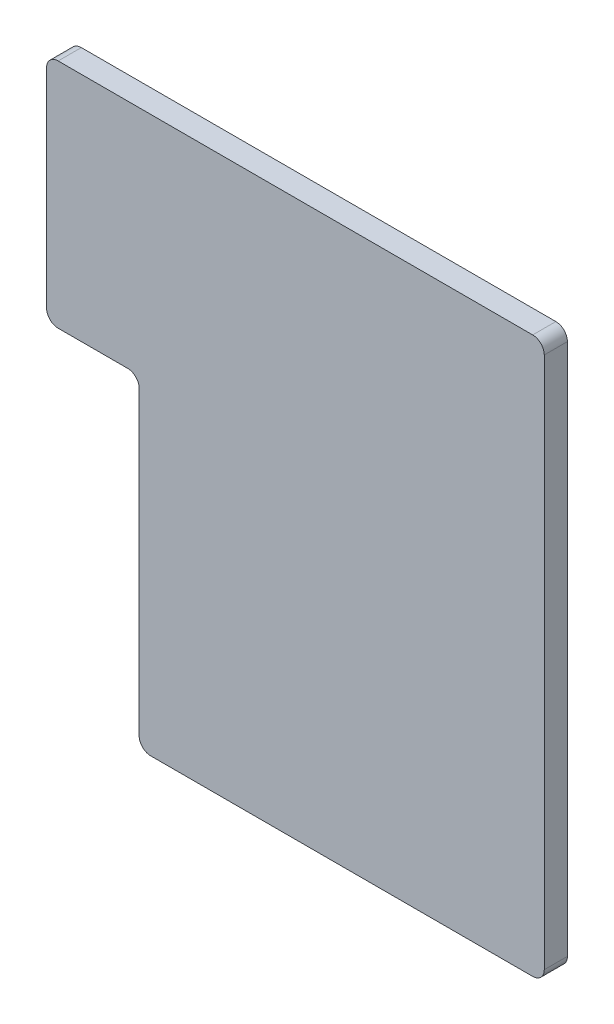
ISO-10303-21;
HEADER;
FILE_DESCRIPTION(('STEP AP214'),'2;1');
FILE_NAME('part.step','',(''),(''),'','','');
FILE_SCHEMA(('AUTOMOTIVE_DESIGN { 1 0 10303 214 1 1 1 1 }'));
ENDSEC;
DATA;
#1=APPLICATION_CONTEXT('core data for automotive mechanical design processes');
#2=APPLICATION_PROTOCOL_DEFINITION('international standard','automotive_design',2000,#1);
#3=PRODUCT_CONTEXT('',#1,'mechanical');
#4=PRODUCT('Part','Part','',(#3));
#5=PRODUCT_RELATED_PRODUCT_CATEGORY('part','',(#4));
#6=PRODUCT_DEFINITION_FORMATION('','',#4);
#7=PRODUCT_DEFINITION_CONTEXT('part definition',#1,'design');
#8=PRODUCT_DEFINITION('design','',#6,#7);
#9=PRODUCT_DEFINITION_SHAPE('','',#8);
#10=(LENGTH_UNIT() NAMED_UNIT(*) SI_UNIT(.MILLI.,.METRE.));
#11=(NAMED_UNIT(*) PLANE_ANGLE_UNIT() SI_UNIT($,.RADIAN.));
#12=(NAMED_UNIT(*) SI_UNIT($,.STERADIAN.) SOLID_ANGLE_UNIT());
#13=UNCERTAINTY_MEASURE_WITH_UNIT(LENGTH_MEASURE(1.E-05),#10,'distance_accuracy_value','');
#14=(GEOMETRIC_REPRESENTATION_CONTEXT(3) GLOBAL_UNCERTAINTY_ASSIGNED_CONTEXT((#13)) GLOBAL_UNIT_ASSIGNED_CONTEXT((#10,
#11,#12)) REPRESENTATION_CONTEXT('',''));
#15=CARTESIAN_POINT('',(0.,0.,0.));
#16=DIRECTION('',(0.,0.,1.));
#17=DIRECTION('',(1.,0.,0.));
#18=AXIS2_PLACEMENT_3D('',#15,#16,#17);
#19=CARTESIAN_POINT('',(17.,0.5,1.));
#20=DIRECTION('',(0.,0.,-1.));
#21=DIRECTION('',(-1.,0.,0.));
#22=AXIS2_PLACEMENT_3D('',#19,#20,#21);
#23=CYLINDRICAL_SURFACE('',#22,0.5);
#24=CARTESIAN_POINT('',(17.,0.5,0.));
#25=DIRECTION('',(0.,0.,1.));
#26=DIRECTION('',(1.,0.,0.));
#27=AXIS2_PLACEMENT_3D('',#24,#25,#26);
#28=CIRCLE('',#27,0.5);
#29=CARTESIAN_POINT('',(17.,0.,0.));
#30=VERTEX_POINT('',#29);
#31=CARTESIAN_POINT('',(17.5,0.500000000000004,0.));
#32=VERTEX_POINT('',#31);
#33=EDGE_CURVE('E248',#30,#32,#28,.T.);
#34=ORIENTED_EDGE('',*,*,#33,.T.);
#35=DIRECTION('',(0.,0.,-1.));
#36=VECTOR('',#35,1.);
#37=CARTESIAN_POINT('',(17.5,0.500000000000004,1.));
#38=LINE('',#37,#36);
#39=CARTESIAN_POINT('',(17.5,0.500000000000004,1.));
#40=VERTEX_POINT('',#39);
#41=EDGE_CURVE('E12',#40,#32,#38,.T.);
#42=ORIENTED_EDGE('',*,*,#41,.F.);
#43=CARTESIAN_POINT('',(17.,0.5,1.));
#44=DIRECTION('',(0.,0.,1.));
#45=DIRECTION('',(1.,0.,0.));
#46=AXIS2_PLACEMENT_3D('',#43,#44,#45);
#47=CIRCLE('',#46,0.5);
#48=CARTESIAN_POINT('',(17.,0.,1.));
#49=VERTEX_POINT('',#48);
#50=EDGE_CURVE('E201',#49,#40,#47,.T.);
#51=ORIENTED_EDGE('',*,*,#50,.F.);
#52=DIRECTION('',(0.,0.,-1.));
#53=VECTOR('',#52,1.);
#54=CARTESIAN_POINT('',(17.,0.,1.));
#55=LINE('',#54,#53);
#56=EDGE_CURVE('E157',#49,#30,#55,.T.);
#57=ORIENTED_EDGE('',*,*,#56,.T.);
#58=EDGE_LOOP('',(#34,#42,#51,#57));
#59=FACE_BOUND('',#58,.T.);
#60=ADVANCED_FACE('F38',(#59),#23,.T.);
#61=CARTESIAN_POINT('',(17.5,0.500000000000004,1.));
#62=DIRECTION('',(-1.,0.,0.));
#63=DIRECTION('',(0.,0.,1.));
#64=AXIS2_PLACEMENT_3D('',#61,#62,#63);
#65=PLANE('',#64);
#66=DIRECTION('',(0.,1.,0.));
#67=VECTOR('',#66,1.);
#68=CARTESIAN_POINT('',(17.5,0.500000000000004,0.));
#69=LINE('',#68,#67);
#70=CARTESIAN_POINT('',(17.5,23.5,0.));
#71=VERTEX_POINT('',#70);
#72=EDGE_CURVE('E242',#32,#71,#69,.T.);
#73=ORIENTED_EDGE('',*,*,#72,.T.);
#74=DIRECTION('',(0.,0.,-1.));
#75=VECTOR('',#74,1.);
#76=CARTESIAN_POINT('',(17.5,23.5,1.));
#77=LINE('',#76,#75);
#78=CARTESIAN_POINT('',(17.5,23.5,1.));
#79=VERTEX_POINT('',#78);
#80=EDGE_CURVE('E46',#79,#71,#77,.T.);
#81=ORIENTED_EDGE('',*,*,#80,.F.);
#82=DIRECTION('',(0.,1.,0.));
#83=VECTOR('',#82,1.);
#84=CARTESIAN_POINT('',(17.5,0.500000000000004,1.));
#85=LINE('',#84,#83);
#86=EDGE_CURVE('E109',#40,#79,#85,.T.);
#87=ORIENTED_EDGE('',*,*,#86,.F.);
#88=ORIENTED_EDGE('',*,*,#41,.T.);
#89=EDGE_LOOP('',(#73,#81,#87,#88));
#90=FACE_BOUND('',#89,.T.);
#91=ADVANCED_FACE('F277',(#90),#65,.F.);
#92=CARTESIAN_POINT('',(17.,23.5,1.));
#93=DIRECTION('',(0.,0.,-1.));
#94=DIRECTION('',(-1.,0.,0.));
#95=AXIS2_PLACEMENT_3D('',#92,#93,#94);
#96=CYLINDRICAL_SURFACE('',#95,0.5);
#97=CARTESIAN_POINT('',(17.,23.5,0.));
#98=DIRECTION('',(0.,0.,1.));
#99=DIRECTION('',(-1.,0.,0.));
#100=AXIS2_PLACEMENT_3D('',#97,#98,#99);
#101=CIRCLE('',#100,0.5);
#102=CARTESIAN_POINT('',(17.,24.,0.));
#103=VERTEX_POINT('',#102);
#104=EDGE_CURVE('E238',#71,#103,#101,.T.);
#105=ORIENTED_EDGE('',*,*,#104,.T.);
#106=DIRECTION('',(0.,0.,-1.));
#107=VECTOR('',#106,1.);
#108=CARTESIAN_POINT('',(17.,24.,1.));
#109=LINE('',#108,#107);
#110=CARTESIAN_POINT('',(17.,24.,1.));
#111=VERTEX_POINT('',#110);
#112=EDGE_CURVE('E229',#111,#103,#109,.T.);
#113=ORIENTED_EDGE('',*,*,#112,.F.);
#114=CARTESIAN_POINT('',(17.,23.5,1.));
#115=DIRECTION('',(0.,0.,1.));
#116=DIRECTION('',(-1.,0.,0.));
#117=AXIS2_PLACEMENT_3D('',#114,#115,#116);
#118=CIRCLE('',#117,0.5);
#119=EDGE_CURVE('E193',#79,#111,#118,.T.);
#120=ORIENTED_EDGE('',*,*,#119,.F.);
#121=ORIENTED_EDGE('',*,*,#80,.T.);
#122=EDGE_LOOP('',(#105,#113,#120,#121));
#123=FACE_BOUND('',#122,.T.);
#124=ADVANCED_FACE('F236',(#123),#96,.T.);
#125=CARTESIAN_POINT('',(1.5,24.,1.));
#126=DIRECTION('',(0.,-1.,0.));
#127=DIRECTION('',(0.,0.,-1.));
#128=AXIS2_PLACEMENT_3D('',#125,#126,#127);
#129=PLANE('',#128);
#130=DIRECTION('',(-1.,0.,0.));
#131=VECTOR('',#130,1.);
#132=CARTESIAN_POINT('',(1.5,24.,0.));
#133=LINE('',#132,#131);
#134=CARTESIAN_POINT('',(-3.5,24.,0.));
#135=VERTEX_POINT('',#134);
#136=EDGE_CURVE('E244',#103,#135,#133,.T.);
#137=ORIENTED_EDGE('',*,*,#136,.T.);
#138=DIRECTION('',(0.,0.,-1.));
#139=VECTOR('',#138,1.);
#140=CARTESIAN_POINT('',(-3.5,24.,1.));
#141=LINE('',#140,#139);
#142=CARTESIAN_POINT('',(-3.5,24.,1.));
#143=VERTEX_POINT('',#142);
#144=EDGE_CURVE('E226',#143,#135,#141,.T.);
#145=ORIENTED_EDGE('',*,*,#144,.F.);
#146=DIRECTION('',(-1.,0.,0.));
#147=VECTOR('',#146,1.);
#148=CARTESIAN_POINT('',(1.5,24.,1.));
#149=LINE('',#148,#147);
#150=EDGE_CURVE('E189',#111,#143,#149,.T.);
#151=ORIENTED_EDGE('',*,*,#150,.F.);
#152=ORIENTED_EDGE('',*,*,#112,.T.);
#153=EDGE_LOOP('',(#137,#145,#151,#152));
#154=FACE_BOUND('',#153,.T.);
#155=ADVANCED_FACE('F284',(#154),#129,.F.);
#156=CARTESIAN_POINT('',(-3.5,23.5,1.));
#157=DIRECTION('',(0.,0.,-1.));
#158=DIRECTION('',(-1.,0.,0.));
#159=AXIS2_PLACEMENT_3D('',#156,#157,#158);
#160=CYLINDRICAL_SURFACE('',#159,0.5);
#161=CARTESIAN_POINT('',(-3.5,23.5,0.));
#162=DIRECTION('',(0.,0.,1.));
#163=DIRECTION('',(1.,0.,0.));
#164=AXIS2_PLACEMENT_3D('',#161,#162,#163);
#165=CIRCLE('',#164,0.5);
#166=CARTESIAN_POINT('',(-4.,23.5,0.));
#167=VERTEX_POINT('',#166);
#168=EDGE_CURVE('E246',#135,#167,#165,.T.);
#169=ORIENTED_EDGE('',*,*,#168,.T.);
#170=DIRECTION('',(0.,0.,-1.));
#171=VECTOR('',#170,1.);
#172=CARTESIAN_POINT('',(-4.,23.5,1.));
#173=LINE('',#172,#171);
#174=CARTESIAN_POINT('',(-4.,23.5,1.));
#175=VERTEX_POINT('',#174);
#176=EDGE_CURVE('E223',#175,#167,#173,.T.);
#177=ORIENTED_EDGE('',*,*,#176,.F.);
#178=CARTESIAN_POINT('',(-3.5,23.5,1.));
#179=DIRECTION('',(0.,0.,1.));
#180=DIRECTION('',(1.,0.,0.));
#181=AXIS2_PLACEMENT_3D('',#178,#179,#180);
#182=CIRCLE('',#181,0.5);
#183=EDGE_CURVE('E186',#143,#175,#182,.T.);
#184=ORIENTED_EDGE('',*,*,#183,.F.);
#185=ORIENTED_EDGE('',*,*,#144,.T.);
#186=EDGE_LOOP('',(#169,#177,#184,#185));
#187=FACE_BOUND('',#186,.T.);
#188=ADVANCED_FACE('F289',(#187),#160,.T.);
#189=CARTESIAN_POINT('',(-4.,23.5,1.));
#190=DIRECTION('',(1.,0.,0.));
#191=DIRECTION('',(0.,1.,0.));
#192=AXIS2_PLACEMENT_3D('',#189,#190,#191);
#193=PLANE('',#192);
#194=DIRECTION('',(0.,-1.,0.));
#195=VECTOR('',#194,1.);
#196=CARTESIAN_POINT('',(-4.,23.5,0.));
#197=LINE('',#196,#195);
#198=CARTESIAN_POINT('',(-4.,14.5,0.));
#199=VERTEX_POINT('',#198);
#200=EDGE_CURVE('E252',#167,#199,#197,.T.);
#201=ORIENTED_EDGE('',*,*,#200,.T.);
#202=DIRECTION('',(0.,0.,-1.));
#203=VECTOR('',#202,1.);
#204=CARTESIAN_POINT('',(-4.,14.5,1.));
#205=LINE('',#204,#203);
#206=CARTESIAN_POINT('',(-4.,14.5,1.));
#207=VERTEX_POINT('',#206);
#208=EDGE_CURVE('E220',#207,#199,#205,.T.);
#209=ORIENTED_EDGE('',*,*,#208,.F.);
#210=DIRECTION('',(0.,-1.,0.));
#211=VECTOR('',#210,1.);
#212=CARTESIAN_POINT('',(-4.,23.5,1.));
#213=LINE('',#212,#211);
#214=EDGE_CURVE('E178',#175,#207,#213,.T.);
#215=ORIENTED_EDGE('',*,*,#214,.F.);
#216=ORIENTED_EDGE('',*,*,#176,.T.);
#217=EDGE_LOOP('',(#201,#209,#215,#216));
#218=FACE_BOUND('',#217,.T.);
#219=ADVANCED_FACE('F293',(#218),#193,.F.);
#220=CARTESIAN_POINT('',(-3.5,14.5,1.));
#221=DIRECTION('',(0.,0.,-1.));
#222=DIRECTION('',(-1.,0.,0.));
#223=AXIS2_PLACEMENT_3D('',#220,#221,#222);
#224=CYLINDRICAL_SURFACE('',#223,0.5);
#225=CARTESIAN_POINT('',(-3.5,14.5,0.));
#226=DIRECTION('',(0.,0.,1.));
#227=DIRECTION('',(1.,0.,0.));
#228=AXIS2_PLACEMENT_3D('',#225,#226,#227);
#229=CIRCLE('',#228,0.5);
#230=CARTESIAN_POINT('',(-3.5,14.,0.));
#231=VERTEX_POINT('',#230);
#232=EDGE_CURVE('E254',#199,#231,#229,.T.);
#233=ORIENTED_EDGE('',*,*,#232,.T.);
#234=DIRECTION('',(0.,0.,-1.));
#235=VECTOR('',#234,1.);
#236=CARTESIAN_POINT('',(-3.5,14.,1.));
#237=LINE('',#236,#235);
#238=CARTESIAN_POINT('',(-3.5,14.,1.));
#239=VERTEX_POINT('',#238);
#240=EDGE_CURVE('E217',#239,#231,#237,.T.);
#241=ORIENTED_EDGE('',*,*,#240,.F.);
#242=CARTESIAN_POINT('',(-3.5,14.5,1.));
#243=DIRECTION('',(0.,0.,1.));
#244=DIRECTION('',(1.,0.,0.));
#245=AXIS2_PLACEMENT_3D('',#242,#243,#244);
#246=CIRCLE('',#245,0.5);
#247=EDGE_CURVE('E174',#207,#239,#246,.T.);
#248=ORIENTED_EDGE('',*,*,#247,.F.);
#249=ORIENTED_EDGE('',*,*,#208,.T.);
#250=EDGE_LOOP('',(#233,#241,#248,#249));
#251=FACE_BOUND('',#250,.T.);
#252=ADVANCED_FACE('F297',(#251),#224,.T.);
#253=CARTESIAN_POINT('',(-3.5,14.,1.));
#254=DIRECTION('',(0.,1.,0.));
#255=DIRECTION('',(0.,0.,1.));
#256=AXIS2_PLACEMENT_3D('',#253,#254,#255);
#257=PLANE('',#256);
#258=DIRECTION('',(1.,0.,0.));
#259=VECTOR('',#258,1.);
#260=CARTESIAN_POINT('',(-3.5,14.,0.));
#261=LINE('',#260,#259);
#262=CARTESIAN_POINT('',(-0.500000000000004,14.,0.));
#263=VERTEX_POINT('',#262);
#264=EDGE_CURVE('E256',#231,#263,#261,.T.);
#265=ORIENTED_EDGE('',*,*,#264,.T.);
#266=DIRECTION('',(0.,0.,-1.));
#267=VECTOR('',#266,1.);
#268=CARTESIAN_POINT('',(-0.500000000000004,14.,1.));
#269=LINE('',#268,#267);
#270=CARTESIAN_POINT('',(-0.500000000000004,14.,1.));
#271=VERTEX_POINT('',#270);
#272=EDGE_CURVE('E214',#271,#263,#269,.T.);
#273=ORIENTED_EDGE('',*,*,#272,.F.);
#274=DIRECTION('',(1.,0.,0.));
#275=VECTOR('',#274,1.);
#276=CARTESIAN_POINT('',(-3.5,14.,1.));
#277=LINE('',#276,#275);
#278=EDGE_CURVE('E170',#239,#271,#277,.T.);
#279=ORIENTED_EDGE('',*,*,#278,.F.);
#280=ORIENTED_EDGE('',*,*,#240,.T.);
#281=EDGE_LOOP('',(#265,#273,#279,#280));
#282=FACE_BOUND('',#281,.T.);
#283=ADVANCED_FACE('F301',(#282),#257,.F.);
#284=CARTESIAN_POINT('',(-0.5,13.5,1.));
#285=DIRECTION('',(0.,0.,-1.));
#286=DIRECTION('',(-1.,0.,0.));
#287=AXIS2_PLACEMENT_3D('',#284,#285,#286);
#288=CYLINDRICAL_SURFACE('',#287,0.5);
#289=CARTESIAN_POINT('',(-0.5,13.5,0.));
#290=DIRECTION('',(0.,0.,-1.));
#291=DIRECTION('',(-1.,0.,0.));
#292=AXIS2_PLACEMENT_3D('',#289,#290,#291);
#293=CIRCLE('',#292,0.5);
#294=CARTESIAN_POINT('',(0.,13.5,0.));
#295=VERTEX_POINT('',#294);
#296=EDGE_CURVE('E258',#263,#295,#293,.T.);
#297=ORIENTED_EDGE('',*,*,#296,.T.);
#298=DIRECTION('',(0.,0.,-1.));
#299=VECTOR('',#298,1.);
#300=CARTESIAN_POINT('',(0.,13.5,1.));
#301=LINE('',#300,#299);
#302=CARTESIAN_POINT('',(0.,13.5,1.));
#303=VERTEX_POINT('',#302);
#304=EDGE_CURVE('E150',#303,#295,#301,.T.);
#305=ORIENTED_EDGE('',*,*,#304,.F.);
#306=CARTESIAN_POINT('',(-0.5,13.5,1.));
#307=DIRECTION('',(0.,0.,-1.));
#308=DIRECTION('',(-1.,0.,0.));
#309=AXIS2_PLACEMENT_3D('',#306,#307,#308);
#310=CIRCLE('',#309,0.5);
#311=EDGE_CURVE('E140',#271,#303,#310,.T.);
#312=ORIENTED_EDGE('',*,*,#311,.F.);
#313=ORIENTED_EDGE('',*,*,#272,.T.);
#314=EDGE_LOOP('',(#297,#305,#312,#313));
#315=FACE_BOUND('',#314,.T.);
#316=ADVANCED_FACE('F261',(#315),#288,.F.);
#317=CARTESIAN_POINT('',(0.,0.500000000000004,1.));
#318=DIRECTION('',(1.,0.,0.));
#319=DIRECTION('',(0.,0.,-1.));
#320=AXIS2_PLACEMENT_3D('',#317,#318,#319);
#321=PLANE('',#320);
#322=DIRECTION('',(0.,-1.,0.));
#323=VECTOR('',#322,1.);
#324=CARTESIAN_POINT('',(0.,0.500000000000004,0.));
#325=LINE('',#324,#323);
#326=CARTESIAN_POINT('',(0.,0.5,0.));
#327=VERTEX_POINT('',#326);
#328=EDGE_CURVE('E149',#295,#327,#325,.T.);
#329=ORIENTED_EDGE('',*,*,#328,.T.);
#330=DIRECTION('',(0.,0.,-1.));
#331=VECTOR('',#330,1.);
#332=CARTESIAN_POINT('',(0.,0.5,1.));
#333=LINE('',#332,#331);
#334=CARTESIAN_POINT('',(0.,0.5,1.));
#335=VERTEX_POINT('',#334);
#336=EDGE_CURVE('E146',#335,#327,#333,.T.);
#337=ORIENTED_EDGE('',*,*,#336,.F.);
#338=DIRECTION('',(0.,-1.,0.));
#339=VECTOR('',#338,1.);
#340=CARTESIAN_POINT('',(0.,0.500000000000004,1.));
#341=LINE('',#340,#339);
#342=EDGE_CURVE('E134',#303,#335,#341,.T.);
#343=ORIENTED_EDGE('',*,*,#342,.F.);
#344=ORIENTED_EDGE('',*,*,#304,.T.);
#345=EDGE_LOOP('',(#329,#337,#343,#344));
#346=FACE_BOUND('',#345,.T.);
#347=ADVANCED_FACE('F147',(#346),#321,.F.);
#348=CARTESIAN_POINT('',(0.5,0.5,1.));
#349=DIRECTION('',(0.,0.,-1.));
#350=DIRECTION('',(-1.,0.,0.));
#351=AXIS2_PLACEMENT_3D('',#348,#349,#350);
#352=CYLINDRICAL_SURFACE('',#351,0.5);
#353=CARTESIAN_POINT('',(0.5,0.5,0.));
#354=DIRECTION('',(0.,0.,1.));
#355=DIRECTION('',(-1.,0.,0.));
#356=AXIS2_PLACEMENT_3D('',#353,#354,#355);
#357=CIRCLE('',#356,0.5);
#358=CARTESIAN_POINT('',(0.500000000000004,0.,0.));
#359=VERTEX_POINT('',#358);
#360=EDGE_CURVE('E95',#327,#359,#357,.T.);
#361=ORIENTED_EDGE('',*,*,#360,.T.);
#362=DIRECTION('',(0.,0.,-1.));
#363=VECTOR('',#362,1.);
#364=CARTESIAN_POINT('',(0.500000000000004,0.,1.));
#365=LINE('',#364,#363);
#366=CARTESIAN_POINT('',(0.500000000000004,0.,1.));
#367=VERTEX_POINT('',#366);
#368=EDGE_CURVE('E151',#367,#359,#365,.T.);
#369=ORIENTED_EDGE('',*,*,#368,.F.);
#370=CARTESIAN_POINT('',(0.5,0.5,1.));
#371=DIRECTION('',(0.,0.,1.));
#372=DIRECTION('',(-1.,0.,0.));
#373=AXIS2_PLACEMENT_3D('',#370,#371,#372);
#374=CIRCLE('',#373,0.5);
#375=EDGE_CURVE('E138',#335,#367,#374,.T.);
#376=ORIENTED_EDGE('',*,*,#375,.F.);
#377=ORIENTED_EDGE('',*,*,#336,.T.);
#378=EDGE_LOOP('',(#361,#369,#376,#377));
#379=FACE_BOUND('',#378,.T.);
#380=ADVANCED_FACE('F153',(#379),#352,.T.);
#381=CARTESIAN_POINT('',(0.500000000000004,0.,1.));
#382=DIRECTION('',(0.,1.,0.));
#383=DIRECTION('',(0.,0.,1.));
#384=AXIS2_PLACEMENT_3D('',#381,#382,#383);
#385=PLANE('',#384);
#386=DIRECTION('',(1.,0.,0.));
#387=VECTOR('',#386,1.);
#388=CARTESIAN_POINT('',(0.500000000000004,0.,0.));
#389=LINE('',#388,#387);
#390=EDGE_CURVE('E101',#359,#30,#389,.T.);
#391=ORIENTED_EDGE('',*,*,#390,.T.);
#392=ORIENTED_EDGE('',*,*,#56,.F.);
#393=DIRECTION('',(1.,0.,0.));
#394=VECTOR('',#393,1.);
#395=CARTESIAN_POINT('',(0.500000000000004,0.,1.));
#396=LINE('',#395,#394);
#397=EDGE_CURVE('E54',#367,#49,#396,.T.);
#398=ORIENTED_EDGE('',*,*,#397,.F.);
#399=ORIENTED_EDGE('',*,*,#368,.T.);
#400=EDGE_LOOP('',(#391,#392,#398,#399));
#401=FACE_BOUND('',#400,.T.);
#402=ADVANCED_FACE('F266',(#401),#385,.F.);
#403=CARTESIAN_POINT('',(17.,0.5,1.));
#404=DIRECTION('',(0.,0.,1.));
#405=DIRECTION('',(1.,0.,0.));
#406=AXIS2_PLACEMENT_3D('',#403,#404,#405);
#407=PLANE('',#406);
#408=ORIENTED_EDGE('',*,*,#50,.T.);
#409=ORIENTED_EDGE('',*,*,#86,.T.);
#410=ORIENTED_EDGE('',*,*,#119,.T.);
#411=ORIENTED_EDGE('',*,*,#150,.T.);
#412=ORIENTED_EDGE('',*,*,#183,.T.);
#413=ORIENTED_EDGE('',*,*,#214,.T.);
#414=ORIENTED_EDGE('',*,*,#247,.T.);
#415=ORIENTED_EDGE('',*,*,#278,.T.);
#416=ORIENTED_EDGE('',*,*,#311,.T.);
#417=ORIENTED_EDGE('',*,*,#342,.T.);
#418=ORIENTED_EDGE('',*,*,#375,.T.);
#419=ORIENTED_EDGE('',*,*,#397,.T.);
#420=EDGE_LOOP('',(#408,#409,#410,#411,#412,#413,#414,#415,#416,#417,#418,#419));
#421=FACE_BOUND('',#420,.T.);
#422=ADVANCED_FACE('F136',(#421),#407,.T.);
#423=CARTESIAN_POINT('',(17.,0.5,0.));
#424=DIRECTION('',(0.,0.,1.));
#425=DIRECTION('',(1.,0.,0.));
#426=AXIS2_PLACEMENT_3D('',#423,#424,#425);
#427=PLANE('',#426);
#428=ORIENTED_EDGE('',*,*,#33,.F.);
#429=ORIENTED_EDGE('',*,*,#390,.F.);
#430=ORIENTED_EDGE('',*,*,#360,.F.);
#431=ORIENTED_EDGE('',*,*,#328,.F.);
#432=ORIENTED_EDGE('',*,*,#296,.F.);
#433=ORIENTED_EDGE('',*,*,#264,.F.);
#434=ORIENTED_EDGE('',*,*,#232,.F.);
#435=ORIENTED_EDGE('',*,*,#200,.F.);
#436=ORIENTED_EDGE('',*,*,#168,.F.);
#437=ORIENTED_EDGE('',*,*,#136,.F.);
#438=ORIENTED_EDGE('',*,*,#104,.F.);
#439=ORIENTED_EDGE('',*,*,#72,.F.);
#440=EDGE_LOOP('',(#428,#429,#430,#431,#432,#433,#434,#435,#436,#437,#438,#439));
#441=FACE_BOUND('',#440,.T.);
#442=ADVANCED_FACE('F241',(#441),#427,.F.);
#443=CLOSED_SHELL('',(#60,#91,#124,#155,#188,#219,#252,#283,#316,#347,#380,#402,#422,#442));
#444=MANIFOLD_SOLID_BREP('B2',#443);
#445=ADVANCED_BREP_SHAPE_REPRESENTATION('',(#18,#444),#14);
#446=SHAPE_DEFINITION_REPRESENTATION(#9,#445);
ENDSEC;
END-ISO-10303-21;
